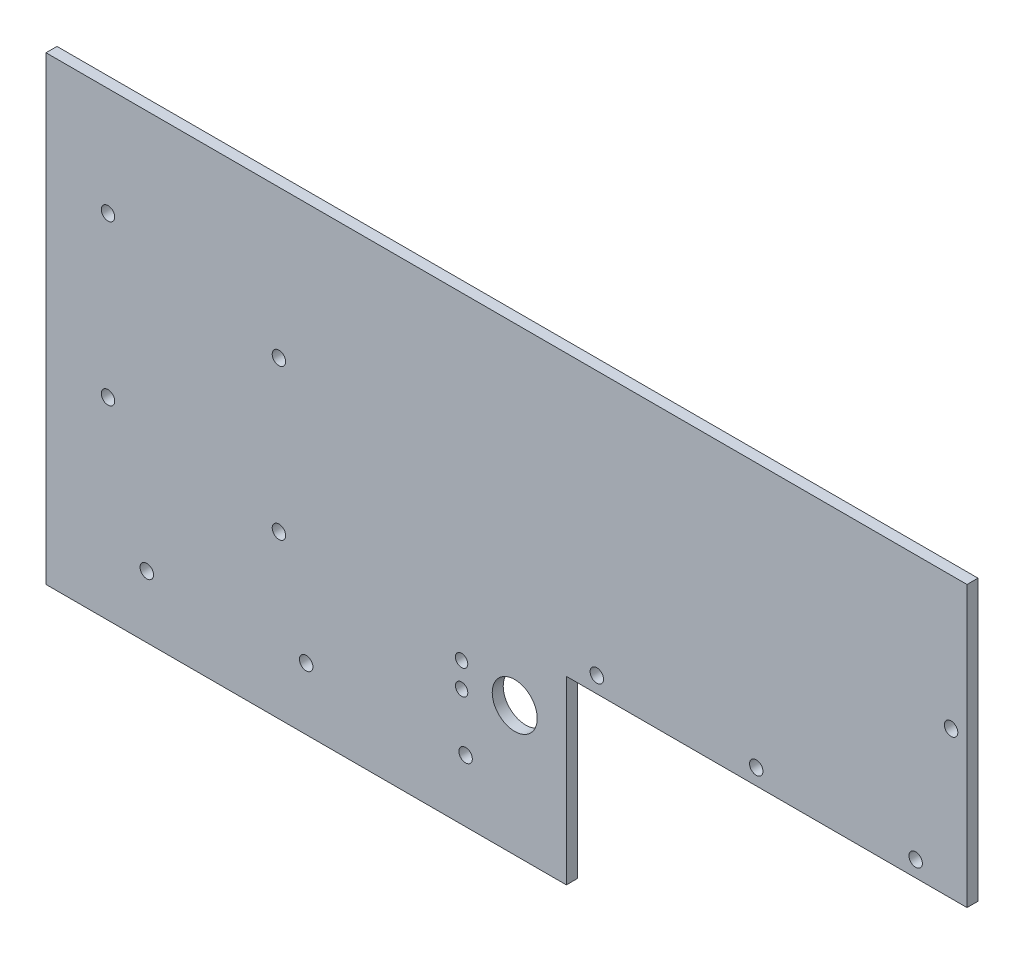
ISO-10303-21;
HEADER;
FILE_DESCRIPTION(('STEP AP214'),'2;1');
FILE_NAME('part.step','',(''),(''),'','','');
FILE_SCHEMA(('AUTOMOTIVE_DESIGN { 1 0 10303 214 1 1 1 1 }'));
ENDSEC;
DATA;
#1=APPLICATION_CONTEXT('core data for automotive mechanical design processes');
#2=APPLICATION_PROTOCOL_DEFINITION('international standard','automotive_design',2000,#1);
#3=PRODUCT_CONTEXT('',#1,'mechanical');
#4=PRODUCT('Part','Part','',(#3));
#5=PRODUCT_RELATED_PRODUCT_CATEGORY('part','',(#4));
#6=PRODUCT_DEFINITION_FORMATION('','',#4);
#7=PRODUCT_DEFINITION_CONTEXT('part definition',#1,'design');
#8=PRODUCT_DEFINITION('design','',#6,#7);
#9=PRODUCT_DEFINITION_SHAPE('','',#8);
#10=(LENGTH_UNIT() NAMED_UNIT(*) SI_UNIT(.MILLI.,.METRE.));
#11=(NAMED_UNIT(*) PLANE_ANGLE_UNIT() SI_UNIT($,.RADIAN.));
#12=(NAMED_UNIT(*) SI_UNIT($,.STERADIAN.) SOLID_ANGLE_UNIT());
#13=UNCERTAINTY_MEASURE_WITH_UNIT(LENGTH_MEASURE(1.E-05),#10,'distance_accuracy_value','');
#14=(GEOMETRIC_REPRESENTATION_CONTEXT(3) GLOBAL_UNCERTAINTY_ASSIGNED_CONTEXT((#13)) GLOBAL_UNIT_ASSIGNED_CONTEXT((#10,
#11,#12)) REPRESENTATION_CONTEXT('',''));
#15=CARTESIAN_POINT('',(0.,0.,0.));
#16=DIRECTION('',(0.,0.,1.));
#17=DIRECTION('',(1.,0.,0.));
#18=AXIS2_PLACEMENT_3D('',#15,#16,#17);
#19=CARTESIAN_POINT('',(130.,-14.,3.1));
#20=DIRECTION('',(-1.,0.,0.));
#21=DIRECTION('',(0.,0.,1.));
#22=AXIS2_PLACEMENT_3D('',#19,#20,#21);
#23=PLANE('',#22);
#24=DIRECTION('',(0.,1.,0.));
#25=VECTOR('',#24,1.);
#26=CARTESIAN_POINT('',(130.,-14.,0.));
#27=LINE('',#26,#25);
#28=CARTESIAN_POINT('',(130.,-14.,0.));
#29=VERTEX_POINT('',#28);
#30=CARTESIAN_POINT('',(130.,65.,0.));
#31=VERTEX_POINT('',#30);
#32=EDGE_CURVE('E127',#29,#31,#27,.T.);
#33=ORIENTED_EDGE('',*,*,#32,.T.);
#34=DIRECTION('',(0.,0.,-1.));
#35=VECTOR('',#34,1.);
#36=CARTESIAN_POINT('',(130.,65.,3.1));
#37=LINE('',#36,#35);
#38=CARTESIAN_POINT('',(130.,65.,3.1));
#39=VERTEX_POINT('',#38);
#40=EDGE_CURVE('E11',#39,#31,#37,.T.);
#41=ORIENTED_EDGE('',*,*,#40,.F.);
#42=DIRECTION('',(0.,1.,0.));
#43=VECTOR('',#42,1.);
#44=CARTESIAN_POINT('',(130.,-14.,3.1));
#45=LINE('',#44,#43);
#46=CARTESIAN_POINT('',(130.,-14.,3.1));
#47=VERTEX_POINT('',#46);
#48=EDGE_CURVE('E144',#47,#39,#45,.T.);
#49=ORIENTED_EDGE('',*,*,#48,.F.);
#50=DIRECTION('',(0.,0.,-1.));
#51=VECTOR('',#50,1.);
#52=CARTESIAN_POINT('',(130.,-14.,3.1));
#53=LINE('',#52,#51);
#54=EDGE_CURVE('E123',#47,#29,#53,.T.);
#55=ORIENTED_EDGE('',*,*,#54,.T.);
#56=EDGE_LOOP('',(#33,#41,#49,#55));
#57=FACE_BOUND('',#56,.T.);
#58=ADVANCED_FACE('F38',(#57),#23,.F.);
#59=CARTESIAN_POINT('',(-130.,65.,3.1));
#60=DIRECTION('',(0.,-1.,0.));
#61=DIRECTION('',(0.,0.,-1.));
#62=AXIS2_PLACEMENT_3D('',#59,#60,#61);
#63=PLANE('',#62);
#64=DIRECTION('',(-1.,0.,0.));
#65=VECTOR('',#64,1.);
#66=CARTESIAN_POINT('',(-130.,65.,0.));
#67=LINE('',#66,#65);
#68=CARTESIAN_POINT('',(-130.,65.,0.));
#69=VERTEX_POINT('',#68);
#70=EDGE_CURVE('E131',#31,#69,#67,.T.);
#71=ORIENTED_EDGE('',*,*,#70,.T.);
#72=DIRECTION('',(0.,0.,-1.));
#73=VECTOR('',#72,1.);
#74=CARTESIAN_POINT('',(-130.,65.,3.1));
#75=LINE('',#74,#73);
#76=CARTESIAN_POINT('',(-130.,65.,3.1));
#77=VERTEX_POINT('',#76);
#78=EDGE_CURVE('E47',#77,#69,#75,.T.);
#79=ORIENTED_EDGE('',*,*,#78,.F.);
#80=DIRECTION('',(-1.,0.,0.));
#81=VECTOR('',#80,1.);
#82=CARTESIAN_POINT('',(-130.,65.,3.1));
#83=LINE('',#82,#81);
#84=EDGE_CURVE('E92',#39,#77,#83,.T.);
#85=ORIENTED_EDGE('',*,*,#84,.F.);
#86=ORIENTED_EDGE('',*,*,#40,.T.);
#87=EDGE_LOOP('',(#71,#79,#85,#86));
#88=FACE_BOUND('',#87,.T.);
#89=ADVANCED_FACE('F174',(#88),#63,.F.);
#90=CARTESIAN_POINT('',(-130.,-65.,3.1));
#91=DIRECTION('',(1.,0.,0.));
#92=DIRECTION('',(0.,0.,-1.));
#93=AXIS2_PLACEMENT_3D('',#90,#91,#92);
#94=PLANE('',#93);
#95=DIRECTION('',(0.,-1.,0.));
#96=VECTOR('',#95,1.);
#97=CARTESIAN_POINT('',(-130.,-65.,0.));
#98=LINE('',#97,#96);
#99=CARTESIAN_POINT('',(-130.,-65.,0.));
#100=VERTEX_POINT('',#99);
#101=EDGE_CURVE('E135',#69,#100,#98,.T.);
#102=ORIENTED_EDGE('',*,*,#101,.T.);
#103=DIRECTION('',(0.,0.,-1.));
#104=VECTOR('',#103,1.);
#105=CARTESIAN_POINT('',(-130.,-65.,3.1));
#106=LINE('',#105,#104);
#107=CARTESIAN_POINT('',(-130.,-65.,3.1));
#108=VERTEX_POINT('',#107);
#109=EDGE_CURVE('E116',#108,#100,#106,.T.);
#110=ORIENTED_EDGE('',*,*,#109,.F.);
#111=DIRECTION('',(0.,-1.,0.));
#112=VECTOR('',#111,1.);
#113=CARTESIAN_POINT('',(-130.,-65.,3.1));
#114=LINE('',#113,#112);
#115=EDGE_CURVE('E105',#77,#108,#114,.T.);
#116=ORIENTED_EDGE('',*,*,#115,.F.);
#117=ORIENTED_EDGE('',*,*,#78,.T.);
#118=EDGE_LOOP('',(#102,#110,#116,#117));
#119=FACE_BOUND('',#118,.T.);
#120=ADVANCED_FACE('F154',(#119),#94,.F.);
#121=CARTESIAN_POINT('',(-130.,-65.,3.1));
#122=DIRECTION('',(0.,1.,0.));
#123=DIRECTION('',(0.,0.,1.));
#124=AXIS2_PLACEMENT_3D('',#121,#122,#123);
#125=PLANE('',#124);
#126=DIRECTION('',(1.,0.,0.));
#127=VECTOR('',#126,1.);
#128=CARTESIAN_POINT('',(-130.,-65.,0.));
#129=LINE('',#128,#127);
#130=CARTESIAN_POINT('',(16.8999999999999,-65.,0.));
#131=VERTEX_POINT('',#130);
#132=EDGE_CURVE('E114',#100,#131,#129,.T.);
#133=ORIENTED_EDGE('',*,*,#132,.T.);
#134=DIRECTION('',(0.,0.,-1.));
#135=VECTOR('',#134,1.);
#136=CARTESIAN_POINT('',(16.8999999999999,-65.,3.1));
#137=LINE('',#136,#135);
#138=CARTESIAN_POINT('',(16.8999999999999,-65.,3.1));
#139=VERTEX_POINT('',#138);
#140=EDGE_CURVE('E111',#139,#131,#137,.T.);
#141=ORIENTED_EDGE('',*,*,#140,.F.);
#142=DIRECTION('',(1.,0.,0.));
#143=VECTOR('',#142,1.);
#144=CARTESIAN_POINT('',(-130.,-65.,3.1));
#145=LINE('',#144,#143);
#146=EDGE_CURVE('E99',#108,#139,#145,.T.);
#147=ORIENTED_EDGE('',*,*,#146,.F.);
#148=ORIENTED_EDGE('',*,*,#109,.T.);
#149=EDGE_LOOP('',(#133,#141,#147,#148));
#150=FACE_BOUND('',#149,.T.);
#151=ADVANCED_FACE('F112',(#150),#125,.F.);
#152=CARTESIAN_POINT('',(16.8999999999999,-14.,3.1));
#153=DIRECTION('',(-1.,0.,0.));
#154=DIRECTION('',(0.,-1.,0.));
#155=AXIS2_PLACEMENT_3D('',#152,#153,#154);
#156=PLANE('',#155);
#157=DIRECTION('',(0.,1.,0.));
#158=VECTOR('',#157,1.);
#159=CARTESIAN_POINT('',(16.8999999999999,-14.,0.));
#160=LINE('',#159,#158);
#161=CARTESIAN_POINT('',(16.8999999999999,-14.,0.));
#162=VERTEX_POINT('',#161);
#163=EDGE_CURVE('E78',#131,#162,#160,.T.);
#164=ORIENTED_EDGE('',*,*,#163,.T.);
#165=DIRECTION('',(0.,0.,-1.));
#166=VECTOR('',#165,1.);
#167=CARTESIAN_POINT('',(16.8999999999999,-14.,3.1));
#168=LINE('',#167,#166);
#169=CARTESIAN_POINT('',(16.8999999999999,-14.,3.1));
#170=VERTEX_POINT('',#169);
#171=EDGE_CURVE('E117',#170,#162,#168,.T.);
#172=ORIENTED_EDGE('',*,*,#171,.F.);
#173=DIRECTION('',(0.,1.,0.));
#174=VECTOR('',#173,1.);
#175=CARTESIAN_POINT('',(16.8999999999999,-14.,3.1));
#176=LINE('',#175,#174);
#177=EDGE_CURVE('E103',#139,#170,#176,.T.);
#178=ORIENTED_EDGE('',*,*,#177,.F.);
#179=ORIENTED_EDGE('',*,*,#140,.T.);
#180=EDGE_LOOP('',(#164,#172,#178,#179));
#181=FACE_BOUND('',#180,.T.);
#182=ADVANCED_FACE('F119',(#181),#156,.F.);
#183=CARTESIAN_POINT('',(130.,-14.,3.1));
#184=DIRECTION('',(0.,1.,0.));
#185=DIRECTION('',(-1.,0.,0.));
#186=AXIS2_PLACEMENT_3D('',#183,#184,#185);
#187=PLANE('',#186);
#188=DIRECTION('',(1.,0.,0.));
#189=VECTOR('',#188,1.);
#190=CARTESIAN_POINT('',(130.,-14.,0.));
#191=LINE('',#190,#189);
#192=EDGE_CURVE('E84',#162,#29,#191,.T.);
#193=ORIENTED_EDGE('',*,*,#192,.T.);
#194=ORIENTED_EDGE('',*,*,#54,.F.);
#195=DIRECTION('',(1.,0.,0.));
#196=VECTOR('',#195,1.);
#197=CARTESIAN_POINT('',(130.,-14.,3.1));
#198=LINE('',#197,#196);
#199=EDGE_CURVE('E55',#170,#47,#198,.T.);
#200=ORIENTED_EDGE('',*,*,#199,.F.);
#201=ORIENTED_EDGE('',*,*,#171,.T.);
#202=EDGE_LOOP('',(#193,#194,#200,#201));
#203=FACE_BOUND('',#202,.T.);
#204=ADVANCED_FACE('F161',(#203),#187,.F.);
#205=CARTESIAN_POINT('',(0.,0.,3.1));
#206=DIRECTION('',(0.,0.,-1.));
#207=DIRECTION('',(-1.,0.,0.));
#208=AXIS2_PLACEMENT_3D('',#205,#206,#207);
#209=PLANE('',#208);
#210=CARTESIAN_POINT('',(2.31737004983734,-28.4195857657904,3.1));
#211=DIRECTION('',(0.,0.,-1.));
#212=DIRECTION('',(-1.,0.,0.));
#213=AXIS2_PLACEMENT_3D('',#210,#211,#212);
#214=CIRCLE('',#213,6.35);
#215=CARTESIAN_POINT('',(-4.03262995016266,-28.4195857657904,3.1));
#216=VERTEX_POINT('',#215);
#217=EDGE_CURVE('E352',#216,#216,#214,.T.);
#218=ORIENTED_EDGE('',*,*,#217,.T.);
#219=EDGE_LOOP('',(#218));
#220=FACE_BOUND('',#219,.T.);
#221=CARTESIAN_POINT('',(-12.6826299501627,-24.9195857657904,3.1));
#222=DIRECTION('',(0.,0.,-1.));
#223=DIRECTION('',(-1.,0.,0.));
#224=AXIS2_PLACEMENT_3D('',#221,#222,#223);
#225=CIRCLE('',#224,1.75);
#226=CARTESIAN_POINT('',(-14.4326299501627,-24.9195857657904,3.1));
#227=VERTEX_POINT('',#226);
#228=EDGE_CURVE('E357',#227,#227,#225,.T.);
#229=ORIENTED_EDGE('',*,*,#228,.T.);
#230=EDGE_LOOP('',(#229));
#231=FACE_BOUND('',#230,.T.);
#232=CARTESIAN_POINT('',(-12.6826299501627,-31.9195857657904,3.1));
#233=DIRECTION('',(0.,0.,-1.));
#234=DIRECTION('',(-1.,0.,0.));
#235=AXIS2_PLACEMENT_3D('',#232,#233,#234);
#236=CIRCLE('',#235,1.75);
#237=CARTESIAN_POINT('',(-14.4326299501627,-31.9195857657904,3.1));
#238=VERTEX_POINT('',#237);
#239=EDGE_CURVE('E370',#238,#238,#236,.T.);
#240=ORIENTED_EDGE('',*,*,#239,.T.);
#241=EDGE_LOOP('',(#240));
#242=FACE_BOUND('',#241,.T.);
#243=CARTESIAN_POINT('',(-112.499500000002,34.5023999999986,3.1));
#244=DIRECTION('',(0.,0.,1.));
#245=DIRECTION('',(1.,0.,0.));
#246=AXIS2_PLACEMENT_3D('',#243,#244,#245);
#247=CIRCLE('',#246,1.89865);
#248=CARTESIAN_POINT('',(-110.600850000002,34.5023999999986,3.1));
#249=VERTEX_POINT('',#248);
#250=EDGE_CURVE('E361',#249,#249,#247,.T.);
#251=ORIENTED_EDGE('',*,*,#250,.F.);
#252=EDGE_LOOP('',(#251));
#253=FACE_BOUND('',#252,.T.);
#254=CARTESIAN_POINT('',(-112.499500000001,-10.4976000000014,3.1));
#255=DIRECTION('',(0.,0.,1.));
#256=DIRECTION('',(1.,0.,0.));
#257=AXIS2_PLACEMENT_3D('',#254,#255,#256);
#258=CIRCLE('',#257,1.89865);
#259=CARTESIAN_POINT('',(-110.600850000001,-10.4976000000014,3.1));
#260=VERTEX_POINT('',#259);
#261=EDGE_CURVE('E385',#260,#260,#258,.T.);
#262=ORIENTED_EDGE('',*,*,#261,.F.);
#263=EDGE_LOOP('',(#262));
#264=FACE_BOUND('',#263,.T.);
#265=CARTESIAN_POINT('',(25.4999999999985,-9.49999999999991,3.1));
#266=DIRECTION('',(0.,0.,1.));
#267=DIRECTION('',(1.,0.,0.));
#268=AXIS2_PLACEMENT_3D('',#265,#266,#267);
#269=CIRCLE('',#268,1.89864999999999);
#270=CARTESIAN_POINT('',(27.3986499999985,-9.49999999999991,3.1));
#271=VERTEX_POINT('',#270);
#272=EDGE_CURVE('E393',#271,#271,#269,.T.);
#273=ORIENTED_EDGE('',*,*,#272,.F.);
#274=EDGE_LOOP('',(#273));
#275=FACE_BOUND('',#274,.T.);
#276=CARTESIAN_POINT('',(70.4999999999985,-9.4999999999999,3.1));
#277=DIRECTION('',(0.,0.,1.));
#278=DIRECTION('',(1.,0.,0.));
#279=AXIS2_PLACEMENT_3D('',#276,#277,#278);
#280=CIRCLE('',#279,1.89864999999999);
#281=CARTESIAN_POINT('',(72.3986499999985,-9.4999999999999,3.1));
#282=VERTEX_POINT('',#281);
#283=EDGE_CURVE('E401',#282,#282,#280,.T.);
#284=ORIENTED_EDGE('',*,*,#283,.F.);
#285=EDGE_LOOP('',(#284));
#286=FACE_BOUND('',#285,.T.);
#287=CARTESIAN_POINT('',(115.499999999999,-9.4999999999999,3.1));
#288=DIRECTION('',(0.,0.,1.));
#289=DIRECTION('',(1.,0.,0.));
#290=AXIS2_PLACEMENT_3D('',#287,#288,#289);
#291=CIRCLE('',#290,1.89864999999999);
#292=CARTESIAN_POINT('',(117.398649999998,-9.4999999999999,3.1));
#293=VERTEX_POINT('',#292);
#294=EDGE_CURVE('E409',#293,#293,#291,.T.);
#295=ORIENTED_EDGE('',*,*,#294,.F.);
#296=EDGE_LOOP('',(#295));
#297=FACE_BOUND('',#296,.T.);
#298=CARTESIAN_POINT('',(-11.5497500000001,-47.4999999999999,3.1));
#299=DIRECTION('',(0.,0.,1.));
#300=DIRECTION('',(1.,0.,0.));
#301=AXIS2_PLACEMENT_3D('',#298,#299,#300);
#302=CIRCLE('',#301,1.89864999999999);
#303=CARTESIAN_POINT('',(-9.65110000000007,-47.4999999999999,3.1));
#304=VERTEX_POINT('',#303);
#305=EDGE_CURVE('E417',#304,#304,#302,.T.);
#306=ORIENTED_EDGE('',*,*,#305,.F.);
#307=EDGE_LOOP('',(#306));
#308=FACE_BOUND('',#307,.T.);
#309=CARTESIAN_POINT('',(-56.5497500000001,-47.4999999999998,3.1));
#310=DIRECTION('',(0.,0.,1.));
#311=DIRECTION('',(1.,0.,0.));
#312=AXIS2_PLACEMENT_3D('',#309,#310,#311);
#313=CIRCLE('',#312,1.89864999999999);
#314=CARTESIAN_POINT('',(-54.6511000000001,-47.4999999999998,3.1));
#315=VERTEX_POINT('',#314);
#316=EDGE_CURVE('E425',#315,#315,#313,.T.);
#317=ORIENTED_EDGE('',*,*,#316,.F.);
#318=EDGE_LOOP('',(#317));
#319=FACE_BOUND('',#318,.T.);
#320=CARTESIAN_POINT('',(-101.54975,-47.4999999999998,3.1));
#321=DIRECTION('',(0.,0.,1.));
#322=DIRECTION('',(1.,0.,0.));
#323=AXIS2_PLACEMENT_3D('',#320,#321,#322);
#324=CIRCLE('',#323,1.89864999999999);
#325=CARTESIAN_POINT('',(-99.6511000000001,-47.4999999999998,3.1));
#326=VERTEX_POINT('',#325);
#327=EDGE_CURVE('E433',#326,#326,#324,.T.);
#328=ORIENTED_EDGE('',*,*,#327,.F.);
#329=EDGE_LOOP('',(#328));
#330=FACE_BOUND('',#329,.T.);
#331=CARTESIAN_POINT('',(125.499999999999,27.5000000000001,3.1));
#332=DIRECTION('',(0.,0.,1.));
#333=DIRECTION('',(1.,0.,0.));
#334=AXIS2_PLACEMENT_3D('',#331,#332,#333);
#335=CIRCLE('',#334,1.89865);
#336=CARTESIAN_POINT('',(127.398649999998,27.5000000000001,3.1));
#337=VERTEX_POINT('',#336);
#338=EDGE_CURVE('E441',#337,#337,#335,.T.);
#339=ORIENTED_EDGE('',*,*,#338,.F.);
#340=EDGE_LOOP('',(#339));
#341=FACE_BOUND('',#340,.T.);
#342=CARTESIAN_POINT('',(-64.2443941367767,-19.2327700817679,3.1));
#343=DIRECTION('',(0.,0.,1.));
#344=DIRECTION('',(1.,0.,0.));
#345=AXIS2_PLACEMENT_3D('',#342,#343,#344);
#346=CIRCLE('',#345,1.89864999999999);
#347=CARTESIAN_POINT('',(-62.3457441367768,-19.2327700817679,3.1));
#348=VERTEX_POINT('',#347);
#349=EDGE_CURVE('E449',#348,#348,#346,.T.);
#350=ORIENTED_EDGE('',*,*,#349,.F.);
#351=EDGE_LOOP('',(#350));
#352=FACE_BOUND('',#351,.T.);
#353=CARTESIAN_POINT('',(-64.2443941367756,23.2672299182336,3.1));
#354=DIRECTION('',(0.,0.,1.));
#355=DIRECTION('',(1.,0.,0.));
#356=AXIS2_PLACEMENT_3D('',#353,#354,#355);
#357=CIRCLE('',#356,1.89864999999999);
#358=CARTESIAN_POINT('',(-62.3457441367756,23.2672299182336,3.1));
#359=VERTEX_POINT('',#358);
#360=EDGE_CURVE('E457',#359,#359,#357,.T.);
#361=ORIENTED_EDGE('',*,*,#360,.F.);
#362=EDGE_LOOP('',(#361));
#363=FACE_BOUND('',#362,.T.);
#364=ORIENTED_EDGE('',*,*,#48,.T.);
#365=ORIENTED_EDGE('',*,*,#84,.T.);
#366=ORIENTED_EDGE('',*,*,#115,.T.);
#367=ORIENTED_EDGE('',*,*,#146,.T.);
#368=ORIENTED_EDGE('',*,*,#177,.T.);
#369=ORIENTED_EDGE('',*,*,#199,.T.);
#370=EDGE_LOOP('',(#364,#365,#366,#367,#368,#369));
#371=FACE_BOUND('',#370,.T.);
#372=ADVANCED_FACE('F101',(#220,#231,#242,#253,#264,#275,#286,#297,#308,#319,#330,#341,#352,
#363,#371),#209,.F.);
#373=CARTESIAN_POINT('',(0.,0.,0.));
#374=DIRECTION('',(0.,0.,-1.));
#375=DIRECTION('',(-1.,0.,0.));
#376=AXIS2_PLACEMENT_3D('',#373,#374,#375);
#377=PLANE('',#376);
#378=CARTESIAN_POINT('',(2.31737004983734,-28.4195857657904,0.));
#379=DIRECTION('',(0.,0.,-1.));
#380=DIRECTION('',(-1.,0.,0.));
#381=AXIS2_PLACEMENT_3D('',#378,#379,#380);
#382=CIRCLE('',#381,6.35);
#383=CARTESIAN_POINT('',(-4.03262995016266,-28.4195857657904,0.));
#384=VERTEX_POINT('',#383);
#385=EDGE_CURVE('E355',#384,#384,#382,.T.);
#386=ORIENTED_EDGE('',*,*,#385,.F.);
#387=EDGE_LOOP('',(#386));
#388=FACE_BOUND('',#387,.T.);
#389=CARTESIAN_POINT('',(-12.6826299501627,-24.9195857657904,0.));
#390=DIRECTION('',(0.,0.,-1.));
#391=DIRECTION('',(-1.,0.,0.));
#392=AXIS2_PLACEMENT_3D('',#389,#390,#391);
#393=CIRCLE('',#392,1.75);
#394=CARTESIAN_POINT('',(-14.4326299501627,-24.9195857657904,0.));
#395=VERTEX_POINT('',#394);
#396=EDGE_CURVE('E364',#395,#395,#393,.T.);
#397=ORIENTED_EDGE('',*,*,#396,.F.);
#398=EDGE_LOOP('',(#397));
#399=FACE_BOUND('',#398,.T.);
#400=CARTESIAN_POINT('',(-12.6826299501627,-31.9195857657904,0.));
#401=DIRECTION('',(0.,0.,-1.));
#402=DIRECTION('',(-1.,0.,0.));
#403=AXIS2_PLACEMENT_3D('',#400,#401,#402);
#404=CIRCLE('',#403,1.75);
#405=CARTESIAN_POINT('',(-14.4326299501627,-31.9195857657904,0.));
#406=VERTEX_POINT('',#405);
#407=EDGE_CURVE('E374',#406,#406,#404,.T.);
#408=ORIENTED_EDGE('',*,*,#407,.F.);
#409=EDGE_LOOP('',(#408));
#410=FACE_BOUND('',#409,.T.);
#411=CARTESIAN_POINT('',(-112.499500000002,34.5023999999986,0.));
#412=DIRECTION('',(0.,0.,1.));
#413=DIRECTION('',(1.,0.,0.));
#414=AXIS2_PLACEMENT_3D('',#411,#412,#413);
#415=CIRCLE('',#414,1.89865);
#416=CARTESIAN_POINT('',(-110.600850000002,34.5023999999986,0.));
#417=VERTEX_POINT('',#416);
#418=EDGE_CURVE('E381',#417,#417,#415,.T.);
#419=ORIENTED_EDGE('',*,*,#418,.T.);
#420=EDGE_LOOP('',(#419));
#421=FACE_BOUND('',#420,.T.);
#422=CARTESIAN_POINT('',(-112.499500000001,-10.4976000000014,0.));
#423=DIRECTION('',(0.,0.,1.));
#424=DIRECTION('',(1.,0.,0.));
#425=AXIS2_PLACEMENT_3D('',#422,#423,#424);
#426=CIRCLE('',#425,1.89865);
#427=CARTESIAN_POINT('',(-110.600850000001,-10.4976000000014,0.));
#428=VERTEX_POINT('',#427);
#429=EDGE_CURVE('E389',#428,#428,#426,.T.);
#430=ORIENTED_EDGE('',*,*,#429,.T.);
#431=EDGE_LOOP('',(#430));
#432=FACE_BOUND('',#431,.T.);
#433=CARTESIAN_POINT('',(25.4999999999985,-9.49999999999991,0.));
#434=DIRECTION('',(0.,0.,1.));
#435=DIRECTION('',(1.,0.,0.));
#436=AXIS2_PLACEMENT_3D('',#433,#434,#435);
#437=CIRCLE('',#436,1.89865);
#438=CARTESIAN_POINT('',(27.3986499999985,-9.49999999999991,0.));
#439=VERTEX_POINT('',#438);
#440=EDGE_CURVE('E397',#439,#439,#437,.T.);
#441=ORIENTED_EDGE('',*,*,#440,.T.);
#442=EDGE_LOOP('',(#441));
#443=FACE_BOUND('',#442,.T.);
#444=CARTESIAN_POINT('',(70.4999999999985,-9.4999999999999,0.));
#445=DIRECTION('',(0.,0.,1.));
#446=DIRECTION('',(1.,0.,0.));
#447=AXIS2_PLACEMENT_3D('',#444,#445,#446);
#448=CIRCLE('',#447,1.89865);
#449=CARTESIAN_POINT('',(72.3986499999985,-9.4999999999999,0.));
#450=VERTEX_POINT('',#449);
#451=EDGE_CURVE('E405',#450,#450,#448,.T.);
#452=ORIENTED_EDGE('',*,*,#451,.T.);
#453=EDGE_LOOP('',(#452));
#454=FACE_BOUND('',#453,.T.);
#455=CARTESIAN_POINT('',(115.499999999999,-9.4999999999999,0.));
#456=DIRECTION('',(0.,0.,1.));
#457=DIRECTION('',(1.,0.,0.));
#458=AXIS2_PLACEMENT_3D('',#455,#456,#457);
#459=CIRCLE('',#458,1.89865);
#460=CARTESIAN_POINT('',(117.398649999999,-9.4999999999999,0.));
#461=VERTEX_POINT('',#460);
#462=EDGE_CURVE('E413',#461,#461,#459,.T.);
#463=ORIENTED_EDGE('',*,*,#462,.T.);
#464=EDGE_LOOP('',(#463));
#465=FACE_BOUND('',#464,.T.);
#466=CARTESIAN_POINT('',(-11.5497500000001,-47.4999999999999,0.));
#467=DIRECTION('',(0.,0.,1.));
#468=DIRECTION('',(1.,0.,0.));
#469=AXIS2_PLACEMENT_3D('',#466,#467,#468);
#470=CIRCLE('',#469,1.89865);
#471=CARTESIAN_POINT('',(-9.65110000000006,-47.4999999999999,0.));
#472=VERTEX_POINT('',#471);
#473=EDGE_CURVE('E421',#472,#472,#470,.T.);
#474=ORIENTED_EDGE('',*,*,#473,.T.);
#475=EDGE_LOOP('',(#474));
#476=FACE_BOUND('',#475,.T.);
#477=CARTESIAN_POINT('',(-56.5497500000001,-47.4999999999998,0.));
#478=DIRECTION('',(0.,0.,1.));
#479=DIRECTION('',(1.,0.,0.));
#480=AXIS2_PLACEMENT_3D('',#477,#478,#479);
#481=CIRCLE('',#480,1.89865);
#482=CARTESIAN_POINT('',(-54.6511000000001,-47.4999999999998,0.));
#483=VERTEX_POINT('',#482);
#484=EDGE_CURVE('E429',#483,#483,#481,.T.);
#485=ORIENTED_EDGE('',*,*,#484,.T.);
#486=EDGE_LOOP('',(#485));
#487=FACE_BOUND('',#486,.T.);
#488=CARTESIAN_POINT('',(-101.54975,-47.4999999999998,0.));
#489=DIRECTION('',(0.,0.,1.));
#490=DIRECTION('',(1.,0.,0.));
#491=AXIS2_PLACEMENT_3D('',#488,#489,#490);
#492=CIRCLE('',#491,1.89865);
#493=CARTESIAN_POINT('',(-99.6511000000001,-47.4999999999998,0.));
#494=VERTEX_POINT('',#493);
#495=EDGE_CURVE('E437',#494,#494,#492,.T.);
#496=ORIENTED_EDGE('',*,*,#495,.T.);
#497=EDGE_LOOP('',(#496));
#498=FACE_BOUND('',#497,.T.);
#499=CARTESIAN_POINT('',(125.499999999999,27.5000000000001,0.));
#500=DIRECTION('',(0.,0.,1.));
#501=DIRECTION('',(1.,0.,0.));
#502=AXIS2_PLACEMENT_3D('',#499,#500,#501);
#503=CIRCLE('',#502,1.89865);
#504=CARTESIAN_POINT('',(127.398649999998,27.5000000000001,0.));
#505=VERTEX_POINT('',#504);
#506=EDGE_CURVE('E445',#505,#505,#503,.T.);
#507=ORIENTED_EDGE('',*,*,#506,.T.);
#508=EDGE_LOOP('',(#507));
#509=FACE_BOUND('',#508,.T.);
#510=CARTESIAN_POINT('',(-64.2443941367767,-19.2327700817679,0.));
#511=DIRECTION('',(0.,0.,1.));
#512=DIRECTION('',(1.,0.,0.));
#513=AXIS2_PLACEMENT_3D('',#510,#511,#512);
#514=CIRCLE('',#513,1.89865);
#515=CARTESIAN_POINT('',(-62.3457441367768,-19.2327700817679,0.));
#516=VERTEX_POINT('',#515);
#517=EDGE_CURVE('E453',#516,#516,#514,.T.);
#518=ORIENTED_EDGE('',*,*,#517,.T.);
#519=EDGE_LOOP('',(#518));
#520=FACE_BOUND('',#519,.T.);
#521=CARTESIAN_POINT('',(-64.2443941367756,23.2672299182336,0.));
#522=DIRECTION('',(0.,0.,1.));
#523=DIRECTION('',(1.,0.,0.));
#524=AXIS2_PLACEMENT_3D('',#521,#522,#523);
#525=CIRCLE('',#524,1.89865);
#526=CARTESIAN_POINT('',(-62.3457441367756,23.2672299182336,0.));
#527=VERTEX_POINT('',#526);
#528=EDGE_CURVE('E132',#527,#527,#525,.T.);
#529=ORIENTED_EDGE('',*,*,#528,.T.);
#530=EDGE_LOOP('',(#529));
#531=FACE_BOUND('',#530,.T.);
#532=ORIENTED_EDGE('',*,*,#32,.F.);
#533=ORIENTED_EDGE('',*,*,#192,.F.);
#534=ORIENTED_EDGE('',*,*,#163,.F.);
#535=ORIENTED_EDGE('',*,*,#132,.F.);
#536=ORIENTED_EDGE('',*,*,#101,.F.);
#537=ORIENTED_EDGE('',*,*,#70,.F.);
#538=EDGE_LOOP('',(#532,#533,#534,#535,#536,#537));
#539=FACE_BOUND('',#538,.T.);
#540=ADVANCED_FACE('F157',(#388,#399,#410,#421,#432,#443,#454,#465,#476,#487,#498,#509,#520,
#531,#539),#377,.T.);
#541=CARTESIAN_POINT('',(-64.2443941367756,23.2672299182336,3.1));
#542=DIRECTION('',(0.,0.,1.));
#543=DIRECTION('',(1.,0.,0.));
#544=AXIS2_PLACEMENT_3D('',#541,#542,#543);
#545=CYLINDRICAL_SURFACE('',#544,1.89864999999999);
#546=ORIENTED_EDGE('',*,*,#528,.F.);
#547=EDGE_LOOP('',(#546));
#548=FACE_BOUND('',#547,.T.);
#549=ORIENTED_EDGE('',*,*,#360,.T.);
#550=EDGE_LOOP('',(#549));
#551=FACE_BOUND('',#550,.T.);
#552=ADVANCED_FACE('F202',(#548,#551),#545,.F.);
#553=CARTESIAN_POINT('',(-64.2443941367767,-19.2327700817679,3.1));
#554=DIRECTION('',(0.,0.,1.));
#555=DIRECTION('',(1.,0.,0.));
#556=AXIS2_PLACEMENT_3D('',#553,#554,#555);
#557=CYLINDRICAL_SURFACE('',#556,1.89864999999999);
#558=ORIENTED_EDGE('',*,*,#517,.F.);
#559=EDGE_LOOP('',(#558));
#560=FACE_BOUND('',#559,.T.);
#561=ORIENTED_EDGE('',*,*,#349,.T.);
#562=EDGE_LOOP('',(#561));
#563=FACE_BOUND('',#562,.T.);
#564=ADVANCED_FACE('F207',(#560,#563),#557,.F.);
#565=CARTESIAN_POINT('',(125.499999999999,27.5000000000001,3.1));
#566=DIRECTION('',(0.,0.,1.));
#567=DIRECTION('',(1.,0.,0.));
#568=AXIS2_PLACEMENT_3D('',#565,#566,#567);
#569=CYLINDRICAL_SURFACE('',#568,1.89865);
#570=ORIENTED_EDGE('',*,*,#506,.F.);
#571=EDGE_LOOP('',(#570));
#572=FACE_BOUND('',#571,.T.);
#573=ORIENTED_EDGE('',*,*,#338,.T.);
#574=EDGE_LOOP('',(#573));
#575=FACE_BOUND('',#574,.T.);
#576=ADVANCED_FACE('F219',(#572,#575),#569,.F.);
#577=CARTESIAN_POINT('',(-101.54975,-47.4999999999998,3.1));
#578=DIRECTION('',(0.,0.,1.));
#579=DIRECTION('',(1.,0.,0.));
#580=AXIS2_PLACEMENT_3D('',#577,#578,#579);
#581=CYLINDRICAL_SURFACE('',#580,1.89864999999999);
#582=ORIENTED_EDGE('',*,*,#495,.F.);
#583=EDGE_LOOP('',(#582));
#584=FACE_BOUND('',#583,.T.);
#585=ORIENTED_EDGE('',*,*,#327,.T.);
#586=EDGE_LOOP('',(#585));
#587=FACE_BOUND('',#586,.T.);
#588=ADVANCED_FACE('F229',(#584,#587),#581,.F.);
#589=CARTESIAN_POINT('',(-56.5497500000001,-47.4999999999998,3.1));
#590=DIRECTION('',(0.,0.,1.));
#591=DIRECTION('',(1.,0.,0.));
#592=AXIS2_PLACEMENT_3D('',#589,#590,#591);
#593=CYLINDRICAL_SURFACE('',#592,1.89864999999999);
#594=ORIENTED_EDGE('',*,*,#484,.F.);
#595=EDGE_LOOP('',(#594));
#596=FACE_BOUND('',#595,.T.);
#597=ORIENTED_EDGE('',*,*,#316,.T.);
#598=EDGE_LOOP('',(#597));
#599=FACE_BOUND('',#598,.T.);
#600=ADVANCED_FACE('F239',(#596,#599),#593,.F.);
#601=CARTESIAN_POINT('',(-11.5497500000001,-47.4999999999999,3.1));
#602=DIRECTION('',(0.,0.,1.));
#603=DIRECTION('',(1.,0.,0.));
#604=AXIS2_PLACEMENT_3D('',#601,#602,#603);
#605=CYLINDRICAL_SURFACE('',#604,1.89864999999999);
#606=ORIENTED_EDGE('',*,*,#473,.F.);
#607=EDGE_LOOP('',(#606));
#608=FACE_BOUND('',#607,.T.);
#609=ORIENTED_EDGE('',*,*,#305,.T.);
#610=EDGE_LOOP('',(#609));
#611=FACE_BOUND('',#610,.T.);
#612=ADVANCED_FACE('F249',(#608,#611),#605,.F.);
#613=CARTESIAN_POINT('',(115.499999999999,-9.4999999999999,3.1));
#614=DIRECTION('',(0.,0.,1.));
#615=DIRECTION('',(1.,0.,0.));
#616=AXIS2_PLACEMENT_3D('',#613,#614,#615);
#617=CYLINDRICAL_SURFACE('',#616,1.89864999999999);
#618=ORIENTED_EDGE('',*,*,#462,.F.);
#619=EDGE_LOOP('',(#618));
#620=FACE_BOUND('',#619,.T.);
#621=ORIENTED_EDGE('',*,*,#294,.T.);
#622=EDGE_LOOP('',(#621));
#623=FACE_BOUND('',#622,.T.);
#624=ADVANCED_FACE('F259',(#620,#623),#617,.F.);
#625=CARTESIAN_POINT('',(70.4999999999985,-9.4999999999999,3.1));
#626=DIRECTION('',(0.,0.,1.));
#627=DIRECTION('',(1.,0.,0.));
#628=AXIS2_PLACEMENT_3D('',#625,#626,#627);
#629=CYLINDRICAL_SURFACE('',#628,1.89864999999999);
#630=ORIENTED_EDGE('',*,*,#451,.F.);
#631=EDGE_LOOP('',(#630));
#632=FACE_BOUND('',#631,.T.);
#633=ORIENTED_EDGE('',*,*,#283,.T.);
#634=EDGE_LOOP('',(#633));
#635=FACE_BOUND('',#634,.T.);
#636=ADVANCED_FACE('F269',(#632,#635),#629,.F.);
#637=CARTESIAN_POINT('',(25.4999999999985,-9.49999999999991,3.1));
#638=DIRECTION('',(0.,0.,1.));
#639=DIRECTION('',(1.,0.,0.));
#640=AXIS2_PLACEMENT_3D('',#637,#638,#639);
#641=CYLINDRICAL_SURFACE('',#640,1.89864999999999);
#642=ORIENTED_EDGE('',*,*,#440,.F.);
#643=EDGE_LOOP('',(#642));
#644=FACE_BOUND('',#643,.T.);
#645=ORIENTED_EDGE('',*,*,#272,.T.);
#646=EDGE_LOOP('',(#645));
#647=FACE_BOUND('',#646,.T.);
#648=ADVANCED_FACE('F279',(#644,#647),#641,.F.);
#649=CARTESIAN_POINT('',(-112.499500000001,-10.4976000000014,3.1));
#650=DIRECTION('',(0.,0.,1.));
#651=DIRECTION('',(1.,0.,0.));
#652=AXIS2_PLACEMENT_3D('',#649,#650,#651);
#653=CYLINDRICAL_SURFACE('',#652,1.89865);
#654=ORIENTED_EDGE('',*,*,#429,.F.);
#655=EDGE_LOOP('',(#654));
#656=FACE_BOUND('',#655,.T.);
#657=ORIENTED_EDGE('',*,*,#261,.T.);
#658=EDGE_LOOP('',(#657));
#659=FACE_BOUND('',#658,.T.);
#660=ADVANCED_FACE('F289',(#656,#659),#653,.F.);
#661=CARTESIAN_POINT('',(-112.499500000002,34.5023999999986,3.1));
#662=DIRECTION('',(0.,0.,1.));
#663=DIRECTION('',(1.,0.,0.));
#664=AXIS2_PLACEMENT_3D('',#661,#662,#663);
#665=CYLINDRICAL_SURFACE('',#664,1.89865);
#666=ORIENTED_EDGE('',*,*,#418,.F.);
#667=EDGE_LOOP('',(#666));
#668=FACE_BOUND('',#667,.T.);
#669=ORIENTED_EDGE('',*,*,#250,.T.);
#670=EDGE_LOOP('',(#669));
#671=FACE_BOUND('',#670,.T.);
#672=ADVANCED_FACE('F299',(#668,#671),#665,.F.);
#673=CARTESIAN_POINT('',(-12.6826299501627,-31.9195857657904,3.1));
#674=DIRECTION('',(0.,0.,-1.));
#675=DIRECTION('',(-1.,0.,0.));
#676=AXIS2_PLACEMENT_3D('',#673,#674,#675);
#677=CYLINDRICAL_SURFACE('',#676,1.75);
#678=ORIENTED_EDGE('',*,*,#239,.F.);
#679=EDGE_LOOP('',(#678));
#680=FACE_BOUND('',#679,.T.);
#681=ORIENTED_EDGE('',*,*,#407,.T.);
#682=EDGE_LOOP('',(#681));
#683=FACE_BOUND('',#682,.T.);
#684=ADVANCED_FACE('F308',(#680,#683),#677,.F.);
#685=CARTESIAN_POINT('',(-12.6826299501627,-24.9195857657904,3.1));
#686=DIRECTION('',(0.,0.,-1.));
#687=DIRECTION('',(-1.,0.,0.));
#688=AXIS2_PLACEMENT_3D('',#685,#686,#687);
#689=CYLINDRICAL_SURFACE('',#688,1.75);
#690=ORIENTED_EDGE('',*,*,#228,.F.);
#691=EDGE_LOOP('',(#690));
#692=FACE_BOUND('',#691,.T.);
#693=ORIENTED_EDGE('',*,*,#396,.T.);
#694=EDGE_LOOP('',(#693));
#695=FACE_BOUND('',#694,.T.);
#696=ADVANCED_FACE('F325',(#692,#695),#689,.F.);
#697=CARTESIAN_POINT('',(2.31737004983734,-28.4195857657904,3.1));
#698=DIRECTION('',(0.,0.,-1.));
#699=DIRECTION('',(-1.,0.,0.));
#700=AXIS2_PLACEMENT_3D('',#697,#698,#699);
#701=CYLINDRICAL_SURFACE('',#700,6.35);
#702=ORIENTED_EDGE('',*,*,#217,.F.);
#703=EDGE_LOOP('',(#702));
#704=FACE_BOUND('',#703,.T.);
#705=ORIENTED_EDGE('',*,*,#385,.T.);
#706=EDGE_LOOP('',(#705));
#707=FACE_BOUND('',#706,.T.);
#708=ADVANCED_FACE('F335',(#704,#707),#701,.F.);
#709=CLOSED_SHELL('',(#58,#89,#120,#151,#182,#204,#372,#540,#552,#564,#576,#588,#600,#612,#624,
#636,#648,#660,#672,#684,#696,#708));
#710=MANIFOLD_SOLID_BREP('B2',#709);
#711=ADVANCED_BREP_SHAPE_REPRESENTATION('',(#18,#710),#14);
#712=SHAPE_DEFINITION_REPRESENTATION(#9,#711);
ENDSEC;
END-ISO-10303-21;
